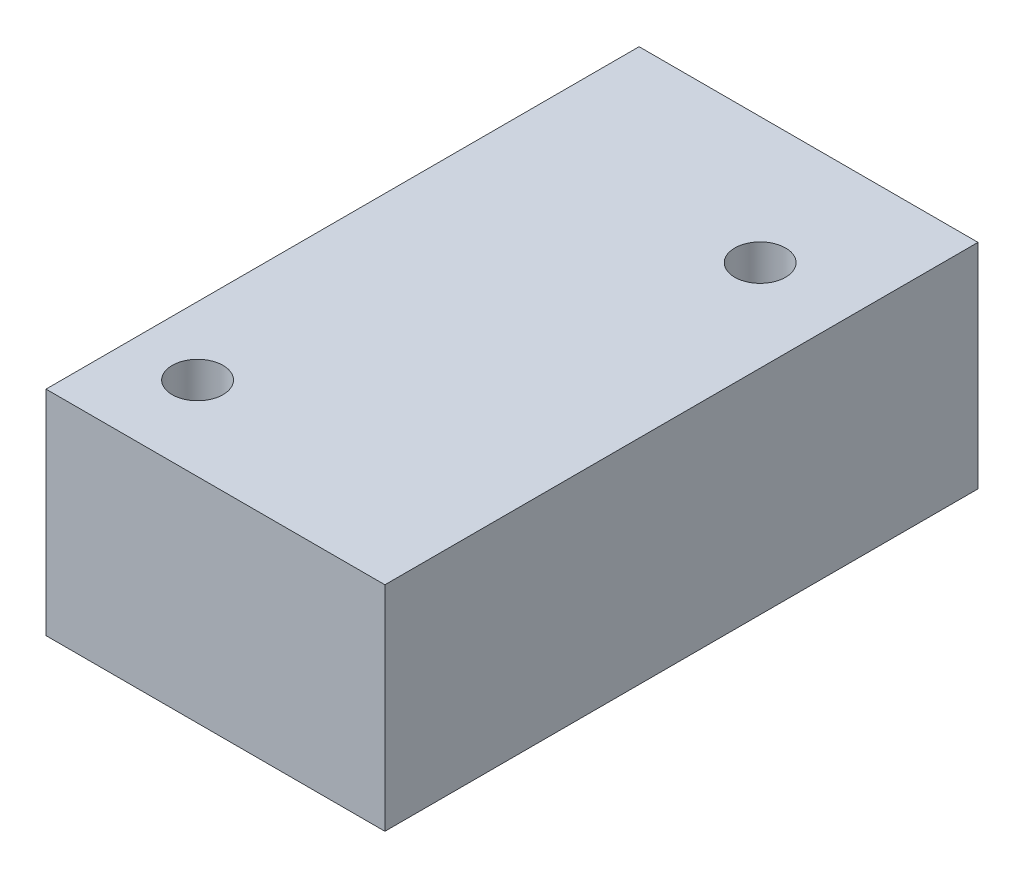
ISO-10303-21;
HEADER;
FILE_DESCRIPTION(('STEP AP214'),'2;1');
FILE_NAME('part.step','',(''),(''),'','','');
FILE_SCHEMA(('AUTOMOTIVE_DESIGN { 1 0 10303 214 1 1 1 1 }'));
ENDSEC;
DATA;
#1=APPLICATION_CONTEXT('core data for automotive mechanical design processes');
#2=APPLICATION_PROTOCOL_DEFINITION('international standard','automotive_design',2000,#1);
#3=PRODUCT_CONTEXT('',#1,'mechanical');
#4=PRODUCT('Part','Part','',(#3));
#5=PRODUCT_RELATED_PRODUCT_CATEGORY('part','',(#4));
#6=PRODUCT_DEFINITION_FORMATION('','',#4);
#7=PRODUCT_DEFINITION_CONTEXT('part definition',#1,'design');
#8=PRODUCT_DEFINITION('design','',#6,#7);
#9=PRODUCT_DEFINITION_SHAPE('','',#8);
#10=(LENGTH_UNIT() NAMED_UNIT(*) SI_UNIT(.MILLI.,.METRE.));
#11=(NAMED_UNIT(*) PLANE_ANGLE_UNIT() SI_UNIT($,.RADIAN.));
#12=(NAMED_UNIT(*) SI_UNIT($,.STERADIAN.) SOLID_ANGLE_UNIT());
#13=UNCERTAINTY_MEASURE_WITH_UNIT(LENGTH_MEASURE(1.E-05),#10,'distance_accuracy_value','');
#14=(GEOMETRIC_REPRESENTATION_CONTEXT(3) GLOBAL_UNCERTAINTY_ASSIGNED_CONTEXT((#13)) GLOBAL_UNIT_ASSIGNED_CONTEXT((#10,
#11,#12)) REPRESENTATION_CONTEXT('',''));
#15=CARTESIAN_POINT('',(0.,0.,0.));
#16=DIRECTION('',(0.,0.,1.));
#17=DIRECTION('',(1.,0.,0.));
#18=AXIS2_PLACEMENT_3D('',#15,#16,#17);
#19=CARTESIAN_POINT('',(10.,12.6,-17.5));
#20=DIRECTION('',(-1.,0.,0.));
#21=DIRECTION('',(0.,0.,1.));
#22=AXIS2_PLACEMENT_3D('',#19,#20,#21);
#23=PLANE('',#22);
#24=DIRECTION('',(0.,0.,-1.));
#25=VECTOR('',#24,1.);
#26=CARTESIAN_POINT('',(10.,0.,-17.5));
#27=LINE('',#26,#25);
#28=CARTESIAN_POINT('',(10.,0.,17.5));
#29=VERTEX_POINT('',#28);
#30=CARTESIAN_POINT('',(10.,0.,-17.5));
#31=VERTEX_POINT('',#30);
#32=EDGE_CURVE('E96',#29,#31,#27,.T.);
#33=ORIENTED_EDGE('',*,*,#32,.T.);
#34=DIRECTION('',(0.,-1.,0.));
#35=VECTOR('',#34,1.);
#36=CARTESIAN_POINT('',(10.,12.6,-17.5));
#37=LINE('',#36,#35);
#38=CARTESIAN_POINT('',(10.,12.6,-17.5));
#39=VERTEX_POINT('',#38);
#40=EDGE_CURVE('E11',#39,#31,#37,.T.);
#41=ORIENTED_EDGE('',*,*,#40,.F.);
#42=DIRECTION('',(0.,0.,-1.));
#43=VECTOR('',#42,1.);
#44=CARTESIAN_POINT('',(10.,12.6,-17.5));
#45=LINE('',#44,#43);
#46=CARTESIAN_POINT('',(10.,12.6,17.5));
#47=VERTEX_POINT('',#46);
#48=EDGE_CURVE('E84',#47,#39,#45,.T.);
#49=ORIENTED_EDGE('',*,*,#48,.F.);
#50=DIRECTION('',(0.,-1.,0.));
#51=VECTOR('',#50,1.);
#52=CARTESIAN_POINT('',(10.,12.6,17.5));
#53=LINE('',#52,#51);
#54=EDGE_CURVE('E92',#47,#29,#53,.T.);
#55=ORIENTED_EDGE('',*,*,#54,.T.);
#56=EDGE_LOOP('',(#33,#41,#49,#55));
#57=FACE_BOUND('',#56,.T.);
#58=ADVANCED_FACE('F33',(#57),#23,.F.);
#59=CARTESIAN_POINT('',(-10.,12.6,-17.5));
#60=DIRECTION('',(0.,0.,1.));
#61=DIRECTION('',(1.,0.,0.));
#62=AXIS2_PLACEMENT_3D('',#59,#60,#61);
#63=PLANE('',#62);
#64=DIRECTION('',(-1.,0.,0.));
#65=VECTOR('',#64,1.);
#66=CARTESIAN_POINT('',(-10.,0.,-17.5));
#67=LINE('',#66,#65);
#68=CARTESIAN_POINT('',(-10.,0.,-17.5));
#69=VERTEX_POINT('',#68);
#70=EDGE_CURVE('E88',#31,#69,#67,.T.);
#71=ORIENTED_EDGE('',*,*,#70,.T.);
#72=DIRECTION('',(0.,-1.,0.));
#73=VECTOR('',#72,1.);
#74=CARTESIAN_POINT('',(-10.,12.6,-17.5));
#75=LINE('',#74,#73);
#76=CARTESIAN_POINT('',(-10.,12.6,-17.5));
#77=VERTEX_POINT('',#76);
#78=EDGE_CURVE('E41',#77,#69,#75,.T.);
#79=ORIENTED_EDGE('',*,*,#78,.F.);
#80=DIRECTION('',(-1.,0.,0.));
#81=VECTOR('',#80,1.);
#82=CARTESIAN_POINT('',(-10.,12.6,-17.5));
#83=LINE('',#82,#81);
#84=EDGE_CURVE('E79',#39,#77,#83,.T.);
#85=ORIENTED_EDGE('',*,*,#84,.F.);
#86=ORIENTED_EDGE('',*,*,#40,.T.);
#87=EDGE_LOOP('',(#71,#79,#85,#86));
#88=FACE_BOUND('',#87,.T.);
#89=ADVANCED_FACE('F87',(#88),#63,.F.);
#90=CARTESIAN_POINT('',(-10.,12.6,-17.5));
#91=DIRECTION('',(1.,0.,0.));
#92=DIRECTION('',(0.,0.,-1.));
#93=AXIS2_PLACEMENT_3D('',#90,#91,#92);
#94=PLANE('',#93);
#95=DIRECTION('',(0.,0.,1.));
#96=VECTOR('',#95,1.);
#97=CARTESIAN_POINT('',(-10.,0.,-17.5));
#98=LINE('',#97,#96);
#99=CARTESIAN_POINT('',(-10.,0.,17.5));
#100=VERTEX_POINT('',#99);
#101=EDGE_CURVE('E66',#69,#100,#98,.T.);
#102=ORIENTED_EDGE('',*,*,#101,.T.);
#103=DIRECTION('',(0.,-1.,0.));
#104=VECTOR('',#103,1.);
#105=CARTESIAN_POINT('',(-10.,12.6,17.5));
#106=LINE('',#105,#104);
#107=CARTESIAN_POINT('',(-10.,12.6,17.5));
#108=VERTEX_POINT('',#107);
#109=EDGE_CURVE('E89',#108,#100,#106,.T.);
#110=ORIENTED_EDGE('',*,*,#109,.F.);
#111=DIRECTION('',(0.,0.,1.));
#112=VECTOR('',#111,1.);
#113=CARTESIAN_POINT('',(-10.,12.6,-17.5));
#114=LINE('',#113,#112);
#115=EDGE_CURVE('E82',#77,#108,#114,.T.);
#116=ORIENTED_EDGE('',*,*,#115,.F.);
#117=ORIENTED_EDGE('',*,*,#78,.T.);
#118=EDGE_LOOP('',(#102,#110,#116,#117));
#119=FACE_BOUND('',#118,.T.);
#120=ADVANCED_FACE('F90',(#119),#94,.F.);
#121=CARTESIAN_POINT('',(-10.,12.6,17.5));
#122=DIRECTION('',(0.,0.,-1.));
#123=DIRECTION('',(-1.,0.,0.));
#124=AXIS2_PLACEMENT_3D('',#121,#122,#123);
#125=PLANE('',#124);
#126=DIRECTION('',(1.,0.,0.));
#127=VECTOR('',#126,1.);
#128=CARTESIAN_POINT('',(-10.,0.,17.5));
#129=LINE('',#128,#127);
#130=EDGE_CURVE('E72',#100,#29,#129,.T.);
#131=ORIENTED_EDGE('',*,*,#130,.T.);
#132=ORIENTED_EDGE('',*,*,#54,.F.);
#133=DIRECTION('',(1.,0.,0.));
#134=VECTOR('',#133,1.);
#135=CARTESIAN_POINT('',(-10.,12.6,17.5));
#136=LINE('',#135,#134);
#137=EDGE_CURVE('E49',#108,#47,#136,.T.);
#138=ORIENTED_EDGE('',*,*,#137,.F.);
#139=ORIENTED_EDGE('',*,*,#109,.T.);
#140=EDGE_LOOP('',(#131,#132,#138,#139));
#141=FACE_BOUND('',#140,.T.);
#142=ADVANCED_FACE('F104',(#141),#125,.F.);
#143=CARTESIAN_POINT('',(0.,12.6,0.));
#144=DIRECTION('',(0.,1.,0.));
#145=DIRECTION('',(0.,0.,1.));
#146=AXIS2_PLACEMENT_3D('',#143,#144,#145);
#147=PLANE('',#146);
#148=CARTESIAN_POINT('',(-5.99064494550024,12.6,12.5633550973545));
#149=DIRECTION('',(0.,1.,0.));
#150=DIRECTION('',(0.,0.,1.));
#151=AXIS2_PLACEMENT_3D('',#148,#149,#150);
#152=CIRCLE('',#151,1.5);
#153=CARTESIAN_POINT('',(-5.99064494550024,12.6,14.0633550973545));
#154=VERTEX_POINT('',#153);
#155=EDGE_CURVE('E116',#154,#154,#152,.F.);
#156=ORIENTED_EDGE('',*,*,#155,.T.);
#157=EDGE_LOOP('',(#156));
#158=FACE_BOUND('',#157,.T.);
#159=CARTESIAN_POINT('',(4.60935505449976,12.6,-10.0366449026455));
#160=DIRECTION('',(0.,1.,0.));
#161=DIRECTION('',(0.,0.,1.));
#162=AXIS2_PLACEMENT_3D('',#159,#160,#161);
#163=CIRCLE('',#162,1.5);
#164=CARTESIAN_POINT('',(4.60935505449976,12.6,-8.53664490264546));
#165=VERTEX_POINT('',#164);
#166=EDGE_CURVE('E110',#165,#165,#163,.F.);
#167=ORIENTED_EDGE('',*,*,#166,.T.);
#168=EDGE_LOOP('',(#167));
#169=FACE_BOUND('',#168,.T.);
#170=ORIENTED_EDGE('',*,*,#48,.T.);
#171=ORIENTED_EDGE('',*,*,#84,.T.);
#172=ORIENTED_EDGE('',*,*,#115,.T.);
#173=ORIENTED_EDGE('',*,*,#137,.T.);
#174=EDGE_LOOP('',(#170,#171,#172,#173));
#175=FACE_BOUND('',#174,.T.);
#176=ADVANCED_FACE('F80',(#158,#169,#175),#147,.T.);
#177=CARTESIAN_POINT('',(0.,0.,0.));
#178=DIRECTION('',(0.,1.,0.));
#179=DIRECTION('',(0.,0.,1.));
#180=AXIS2_PLACEMENT_3D('',#177,#178,#179);
#181=PLANE('',#180);
#182=CARTESIAN_POINT('',(-5.99064494550024,0.,12.5633550973545));
#183=DIRECTION('',(0.,-1.,0.));
#184=DIRECTION('',(0.,0.,-1.));
#185=AXIS2_PLACEMENT_3D('',#182,#183,#184);
#186=CIRCLE('',#185,1.5);
#187=CARTESIAN_POINT('',(-5.99064494550024,0.,11.0633550973545));
#188=VERTEX_POINT('',#187);
#189=EDGE_CURVE('E99',#188,#188,#186,.T.);
#190=ORIENTED_EDGE('',*,*,#189,.F.);
#191=EDGE_LOOP('',(#190));
#192=FACE_BOUND('',#191,.T.);
#193=CARTESIAN_POINT('',(4.60935505449976,0.,-10.0366449026455));
#194=DIRECTION('',(0.,-1.,0.));
#195=DIRECTION('',(0.,0.,-1.));
#196=AXIS2_PLACEMENT_3D('',#193,#194,#195);
#197=CIRCLE('',#196,1.5);
#198=CARTESIAN_POINT('',(4.60935505449976,0.,-11.5366449026455));
#199=VERTEX_POINT('',#198);
#200=EDGE_CURVE('E113',#199,#199,#197,.T.);
#201=ORIENTED_EDGE('',*,*,#200,.F.);
#202=EDGE_LOOP('',(#201));
#203=FACE_BOUND('',#202,.T.);
#204=ORIENTED_EDGE('',*,*,#32,.F.);
#205=ORIENTED_EDGE('',*,*,#130,.F.);
#206=ORIENTED_EDGE('',*,*,#101,.F.);
#207=ORIENTED_EDGE('',*,*,#70,.F.);
#208=EDGE_LOOP('',(#204,#205,#206,#207));
#209=FACE_BOUND('',#208,.T.);
#210=ADVANCED_FACE('F107',(#192,#203,#209),#181,.F.);
#211=CARTESIAN_POINT('',(4.60935505449976,12.601,-10.0366449026455));
#212=DIRECTION('',(0.,-1.,0.));
#213=DIRECTION('',(0.,0.,-1.));
#214=AXIS2_PLACEMENT_3D('',#211,#212,#213);
#215=CYLINDRICAL_SURFACE('',#214,1.5);
#216=ORIENTED_EDGE('',*,*,#166,.F.);
#217=EDGE_LOOP('',(#216));
#218=FACE_BOUND('',#217,.T.);
#219=ORIENTED_EDGE('',*,*,#200,.T.);
#220=EDGE_LOOP('',(#219));
#221=FACE_BOUND('',#220,.T.);
#222=ADVANCED_FACE('F126',(#218,#221),#215,.F.);
#223=CARTESIAN_POINT('',(-5.99064494550024,12.601,12.5633550973545));
#224=DIRECTION('',(0.,-1.,0.));
#225=DIRECTION('',(0.,0.,-1.));
#226=AXIS2_PLACEMENT_3D('',#223,#224,#225);
#227=CYLINDRICAL_SURFACE('',#226,1.5);
#228=ORIENTED_EDGE('',*,*,#155,.F.);
#229=EDGE_LOOP('',(#228));
#230=FACE_BOUND('',#229,.T.);
#231=ORIENTED_EDGE('',*,*,#189,.T.);
#232=EDGE_LOOP('',(#231));
#233=FACE_BOUND('',#232,.T.);
#234=ADVANCED_FACE('F122',(#230,#233),#227,.F.);
#235=CLOSED_SHELL('',(#58,#89,#120,#142,#176,#210,#222,#234));
#236=MANIFOLD_SOLID_BREP('B2',#235);
#237=ADVANCED_BREP_SHAPE_REPRESENTATION('',(#18,#236),#14);
#238=SHAPE_DEFINITION_REPRESENTATION(#9,#237);
ENDSEC;
END-ISO-10303-21;
